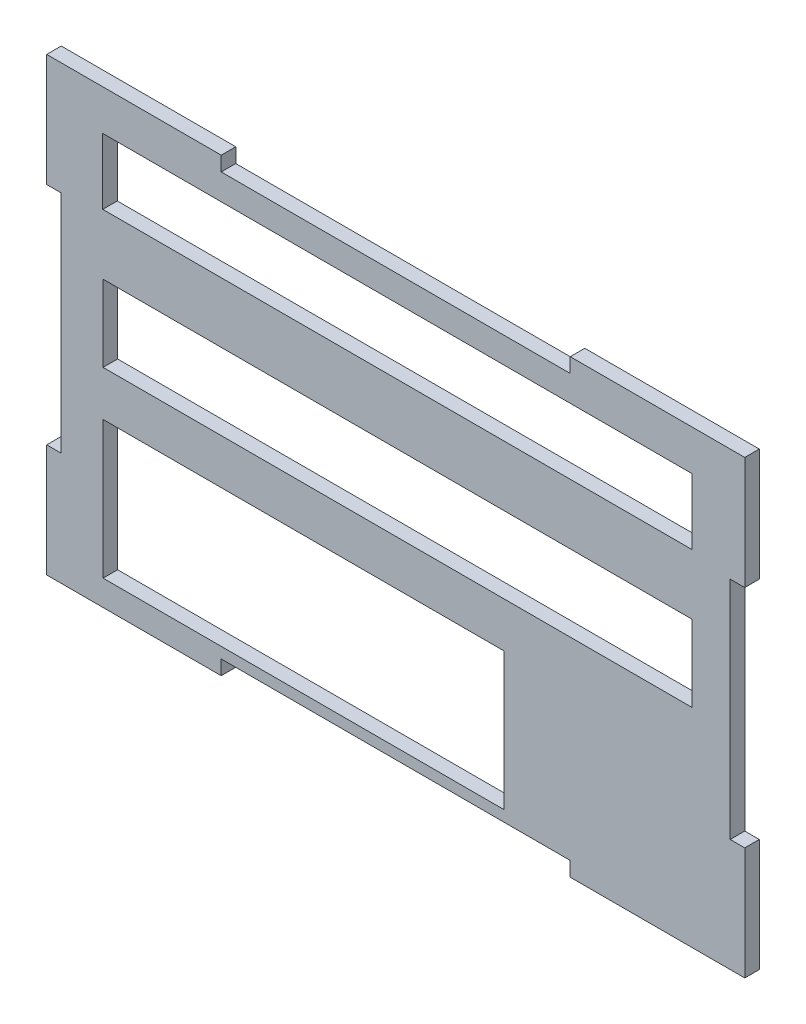
ISO-10303-21;
HEADER;
FILE_DESCRIPTION(('STEP AP214'),'2;1');
FILE_NAME('part.step','',(''),(''),'','','');
FILE_SCHEMA(('AUTOMOTIVE_DESIGN { 1 0 10303 214 1 1 1 1 }'));
ENDSEC;
DATA;
#1=APPLICATION_CONTEXT('core data for automotive mechanical design processes');
#2=APPLICATION_PROTOCOL_DEFINITION('international standard','automotive_design',2000,#1);
#3=PRODUCT_CONTEXT('',#1,'mechanical');
#4=PRODUCT('Part','Part','',(#3));
#5=PRODUCT_RELATED_PRODUCT_CATEGORY('part','',(#4));
#6=PRODUCT_DEFINITION_FORMATION('','',#4);
#7=PRODUCT_DEFINITION_CONTEXT('part definition',#1,'design');
#8=PRODUCT_DEFINITION('design','',#6,#7);
#9=PRODUCT_DEFINITION_SHAPE('','',#8);
#10=(LENGTH_UNIT() NAMED_UNIT(*) SI_UNIT(.MILLI.,.METRE.));
#11=(NAMED_UNIT(*) PLANE_ANGLE_UNIT() SI_UNIT($,.RADIAN.));
#12=(NAMED_UNIT(*) SI_UNIT($,.STERADIAN.) SOLID_ANGLE_UNIT());
#13=UNCERTAINTY_MEASURE_WITH_UNIT(LENGTH_MEASURE(1.E-05),#10,'distance_accuracy_value','');
#14=(GEOMETRIC_REPRESENTATION_CONTEXT(3) GLOBAL_UNCERTAINTY_ASSIGNED_CONTEXT((#13)) GLOBAL_UNIT_ASSIGNED_CONTEXT((#10,
#11,#12)) REPRESENTATION_CONTEXT('',''));
#15=CARTESIAN_POINT('',(0.,0.,0.));
#16=DIRECTION('',(0.,0.,1.));
#17=DIRECTION('',(1.,0.,0.));
#18=AXIS2_PLACEMENT_3D('',#15,#16,#17);
#19=CARTESIAN_POINT('',(53.3111861317648,28.2641509433962,2.));
#20=DIRECTION('',(-1.,0.,0.));
#21=DIRECTION('',(0.,-1.,0.));
#22=AXIS2_PLACEMENT_3D('',#19,#20,#21);
#23=PLANE('',#22);
#24=DIRECTION('',(0.,1.,0.));
#25=VECTOR('',#24,1.);
#26=CARTESIAN_POINT('',(53.3111861317648,28.2641509433962,2.));
#27=LINE('',#26,#25);
#28=CARTESIAN_POINT('',(53.3111861317653,12.7641509433962,2.));
#29=VERTEX_POINT('',#28);
#30=CARTESIAN_POINT('',(53.3111861317648,28.2641509433962,2.));
#31=VERTEX_POINT('',#30);
#32=EDGE_CURVE('E270',#29,#31,#27,.T.);
#33=ORIENTED_EDGE('',*,*,#32,.F.);
#34=DIRECTION('',(0.,0.,-1.));
#35=VECTOR('',#34,1.);
#36=CARTESIAN_POINT('',(53.3111861317653,12.7641509433962,2.));
#37=LINE('',#36,#35);
#38=CARTESIAN_POINT('',(53.3111861317653,12.7641509433962,0.));
#39=VERTEX_POINT('',#38);
#40=EDGE_CURVE('E316',#29,#39,#37,.T.);
#41=ORIENTED_EDGE('',*,*,#40,.T.);
#42=DIRECTION('',(0.,1.,0.));
#43=VECTOR('',#42,1.);
#44=CARTESIAN_POINT('',(53.3111861317648,28.2641509433962,0.));
#45=LINE('',#44,#43);
#46=CARTESIAN_POINT('',(53.3111861317648,28.2641509433962,0.));
#47=VERTEX_POINT('',#46);
#48=EDGE_CURVE('E288',#39,#47,#45,.T.);
#49=ORIENTED_EDGE('',*,*,#48,.T.);
#50=DIRECTION('',(0.,0.,-1.));
#51=VECTOR('',#50,1.);
#52=CARTESIAN_POINT('',(53.3111861317648,28.2641509433962,2.));
#53=LINE('',#52,#51);
#54=EDGE_CURVE('E297',#31,#47,#53,.T.);
#55=ORIENTED_EDGE('',*,*,#54,.F.);
#56=EDGE_LOOP('',(#33,#41,#49,#55));
#57=FACE_BOUND('',#56,.T.);
#58=ADVANCED_FACE('F33',(#57),#23,.F.);
#59=CARTESIAN_POINT('',(-42.6888138682352,28.2641509433962,2.));
#60=DIRECTION('',(1.,0.,0.));
#61=DIRECTION('',(0.,1.,0.));
#62=AXIS2_PLACEMENT_3D('',#59,#60,#61);
#63=PLANE('',#62);
#64=DIRECTION('',(0.,-1.,0.));
#65=VECTOR('',#64,1.);
#66=CARTESIAN_POINT('',(-42.6888138682352,28.2641509433962,2.));
#67=LINE('',#66,#65);
#68=CARTESIAN_POINT('',(-42.6888138682347,-18.2358490566038,2.));
#69=VERTEX_POINT('',#68);
#70=CARTESIAN_POINT('',(-42.6888138682352,-33.7358490566038,2.));
#71=VERTEX_POINT('',#70);
#72=EDGE_CURVE('E294',#69,#71,#67,.T.);
#73=ORIENTED_EDGE('',*,*,#72,.F.);
#74=DIRECTION('',(0.,0.,-1.));
#75=VECTOR('',#74,1.);
#76=CARTESIAN_POINT('',(-42.6888138682347,-18.2358490566038,2.));
#77=LINE('',#76,#75);
#78=CARTESIAN_POINT('',(-42.6888138682347,-18.2358490566038,0.));
#79=VERTEX_POINT('',#78);
#80=EDGE_CURVE('E338',#69,#79,#77,.T.);
#81=ORIENTED_EDGE('',*,*,#80,.T.);
#82=DIRECTION('',(0.,-1.,0.));
#83=VECTOR('',#82,1.);
#84=CARTESIAN_POINT('',(-42.6888138682352,28.2641509433962,0.));
#85=LINE('',#84,#83);
#86=CARTESIAN_POINT('',(-42.6888138682352,-33.7358490566038,0.));
#87=VERTEX_POINT('',#86);
#88=EDGE_CURVE('E284',#79,#87,#85,.T.);
#89=ORIENTED_EDGE('',*,*,#88,.T.);
#90=DIRECTION('',(0.,0.,-1.));
#91=VECTOR('',#90,1.);
#92=CARTESIAN_POINT('',(-42.6888138682352,-33.7358490566038,2.));
#93=LINE('',#92,#91);
#94=EDGE_CURVE('E11',#71,#87,#93,.T.);
#95=ORIENTED_EDGE('',*,*,#94,.F.);
#96=EDGE_LOOP('',(#73,#81,#89,#95));
#97=FACE_BOUND('',#96,.T.);
#98=ADVANCED_FACE('F504',(#97),#63,.F.);
#99=CARTESIAN_POINT('',(-42.6888138682352,28.2641509433962,2.));
#100=DIRECTION('',(0.,-1.,0.));
#101=DIRECTION('',(0.,0.,-1.));
#102=AXIS2_PLACEMENT_3D('',#99,#100,#101);
#103=PLANE('',#102);
#104=DIRECTION('',(-1.,0.,0.));
#105=VECTOR('',#104,1.);
#106=CARTESIAN_POINT('',(-42.6888138682352,28.2641509433962,0.));
#107=LINE('',#106,#105);
#108=CARTESIAN_POINT('',(29.3111861317648,28.2641509433962,0.));
#109=VERTEX_POINT('',#108);
#110=EDGE_CURVE('E291',#47,#109,#107,.T.);
#111=ORIENTED_EDGE('',*,*,#110,.T.);
#112=DIRECTION('',(0.,0.,-1.));
#113=VECTOR('',#112,1.);
#114=CARTESIAN_POINT('',(29.3111861317648,28.2641509433962,2.));
#115=LINE('',#114,#113);
#116=CARTESIAN_POINT('',(29.3111861317648,28.2641509433962,2.));
#117=VERTEX_POINT('',#116);
#118=EDGE_CURVE('E363',#117,#109,#115,.T.);
#119=ORIENTED_EDGE('',*,*,#118,.F.);
#120=DIRECTION('',(-1.,0.,0.));
#121=VECTOR('',#120,1.);
#122=CARTESIAN_POINT('',(-42.6888138682352,28.2641509433962,2.));
#123=LINE('',#122,#121);
#124=EDGE_CURVE('E272',#31,#117,#123,.T.);
#125=ORIENTED_EDGE('',*,*,#124,.F.);
#126=ORIENTED_EDGE('',*,*,#54,.T.);
#127=EDGE_LOOP('',(#111,#119,#125,#126));
#128=FACE_BOUND('',#127,.T.);
#129=ADVANCED_FACE('F520',(#128),#103,.F.);
#130=CARTESIAN_POINT('',(-42.6888138682352,-33.7358490566038,2.));
#131=DIRECTION('',(0.,1.,0.));
#132=DIRECTION('',(0.,0.,1.));
#133=AXIS2_PLACEMENT_3D('',#130,#131,#132);
#134=PLANE('',#133);
#135=DIRECTION('',(1.,0.,0.));
#136=VECTOR('',#135,1.);
#137=CARTESIAN_POINT('',(-42.6888138682352,-33.7358490566038,2.));
#138=LINE('',#137,#136);
#139=CARTESIAN_POINT('',(29.3111861317648,-33.7358490566038,2.));
#140=VERTEX_POINT('',#139);
#141=CARTESIAN_POINT('',(53.3111861317648,-33.7358490566038,2.));
#142=VERTEX_POINT('',#141);
#143=EDGE_CURVE('E267',#140,#142,#138,.T.);
#144=ORIENTED_EDGE('',*,*,#143,.F.);
#145=DIRECTION('',(0.,0.,-1.));
#146=VECTOR('',#145,1.);
#147=CARTESIAN_POINT('',(29.3111861317648,-33.7358490566038,2.));
#148=LINE('',#147,#146);
#149=CARTESIAN_POINT('',(29.3111861317648,-33.7358490566038,0.));
#150=VERTEX_POINT('',#149);
#151=EDGE_CURVE('E382',#140,#150,#148,.T.);
#152=ORIENTED_EDGE('',*,*,#151,.T.);
#153=DIRECTION('',(1.,0.,0.));
#154=VECTOR('',#153,1.);
#155=CARTESIAN_POINT('',(-42.6888138682352,-33.7358490566038,0.));
#156=LINE('',#155,#154);
#157=CARTESIAN_POINT('',(53.3111861317648,-33.7358490566038,0.));
#158=VERTEX_POINT('',#157);
#159=EDGE_CURVE('E283',#150,#158,#156,.T.);
#160=ORIENTED_EDGE('',*,*,#159,.T.);
#161=DIRECTION('',(0.,0.,-1.));
#162=VECTOR('',#161,1.);
#163=CARTESIAN_POINT('',(53.3111861317648,-33.7358490566038,2.));
#164=LINE('',#163,#162);
#165=EDGE_CURVE('E41',#142,#158,#164,.T.);
#166=ORIENTED_EDGE('',*,*,#165,.F.);
#167=EDGE_LOOP('',(#144,#152,#160,#166));
#168=FACE_BOUND('',#167,.T.);
#169=ADVANCED_FACE('F518',(#168),#134,.F.);
#170=CARTESIAN_POINT('',(-42.6888138682352,28.2641509433962,0.));
#171=VERTEX_POINT('',#170);
#172=CARTESIAN_POINT('',(-42.6888138682352,12.7641509433962,0.));
#173=VERTEX_POINT('',#172);
#174=EDGE_CURVE('E280',#171,#173,#85,.T.);
#175=ORIENTED_EDGE('',*,*,#174,.T.);
#176=DIRECTION('',(0.,0.,-1.));
#177=VECTOR('',#176,1.);
#178=CARTESIAN_POINT('',(-42.6888138682347,12.7641509433962,2.));
#179=LINE('',#178,#177);
#180=CARTESIAN_POINT('',(-42.6888138682347,12.7641509433962,2.));
#181=VERTEX_POINT('',#180);
#182=EDGE_CURVE('E56',#181,#173,#179,.T.);
#183=ORIENTED_EDGE('',*,*,#182,.F.);
#184=CARTESIAN_POINT('',(-42.6888138682352,28.2641509433962,2.));
#185=VERTEX_POINT('',#184);
#186=EDGE_CURVE('E492',#185,#181,#67,.T.);
#187=ORIENTED_EDGE('',*,*,#186,.F.);
#188=DIRECTION('',(0.,0.,-1.));
#189=VECTOR('',#188,1.);
#190=CARTESIAN_POINT('',(-42.6888138682352,28.2641509433962,2.));
#191=LINE('',#190,#189);
#192=EDGE_CURVE('E279',#185,#171,#191,.T.);
#193=ORIENTED_EDGE('',*,*,#192,.T.);
#194=EDGE_LOOP('',(#175,#183,#187,#193));
#195=FACE_BOUND('',#194,.T.);
#196=ADVANCED_FACE('F35',(#195),#63,.F.);
#197=CARTESIAN_POINT('',(-18.6888138682352,-33.7358490566038,0.));
#198=VERTEX_POINT('',#197);
#199=EDGE_CURVE('E285',#87,#198,#156,.T.);
#200=ORIENTED_EDGE('',*,*,#199,.T.);
#201=DIRECTION('',(0.,0.,-1.));
#202=VECTOR('',#201,1.);
#203=CARTESIAN_POINT('',(-18.6888138682352,-33.7358490566038,2.));
#204=LINE('',#203,#202);
#205=CARTESIAN_POINT('',(-18.6888138682352,-33.7358490566038,2.));
#206=VERTEX_POINT('',#205);
#207=EDGE_CURVE('E394',#206,#198,#204,.T.);
#208=ORIENTED_EDGE('',*,*,#207,.F.);
#209=EDGE_CURVE('E274',#71,#206,#138,.T.);
#210=ORIENTED_EDGE('',*,*,#209,.F.);
#211=ORIENTED_EDGE('',*,*,#94,.T.);
#212=EDGE_LOOP('',(#200,#208,#210,#211));
#213=FACE_BOUND('',#212,.T.);
#214=ADVANCED_FACE('F503',(#213),#134,.F.);
#215=CARTESIAN_POINT('',(53.3111861317648,-18.2358490566038,0.));
#216=VERTEX_POINT('',#215);
#217=EDGE_CURVE('E259',#158,#216,#45,.T.);
#218=ORIENTED_EDGE('',*,*,#217,.T.);
#219=DIRECTION('',(0.,0.,-1.));
#220=VECTOR('',#219,1.);
#221=CARTESIAN_POINT('',(53.3111861317653,-18.2358490566038,2.));
#222=LINE('',#221,#220);
#223=CARTESIAN_POINT('',(53.3111861317653,-18.2358490566038,2.));
#224=VERTEX_POINT('',#223);
#225=EDGE_CURVE('E48',#224,#216,#222,.T.);
#226=ORIENTED_EDGE('',*,*,#225,.F.);
#227=EDGE_CURVE('E257',#142,#224,#27,.T.);
#228=ORIENTED_EDGE('',*,*,#227,.F.);
#229=ORIENTED_EDGE('',*,*,#165,.T.);
#230=EDGE_LOOP('',(#218,#226,#228,#229));
#231=FACE_BOUND('',#230,.T.);
#232=ADVANCED_FACE('F255',(#231),#23,.F.);
#233=CARTESIAN_POINT('',(-18.6888138682352,28.2641509433962,2.));
#234=VERTEX_POINT('',#233);
#235=EDGE_CURVE('E269',#234,#185,#123,.T.);
#236=ORIENTED_EDGE('',*,*,#235,.F.);
#237=DIRECTION('',(0.,0.,-1.));
#238=VECTOR('',#237,1.);
#239=CARTESIAN_POINT('',(-18.6888138682352,28.2641509433962,2.));
#240=LINE('',#239,#238);
#241=CARTESIAN_POINT('',(-18.6888138682352,28.2641509433962,0.));
#242=VERTEX_POINT('',#241);
#243=EDGE_CURVE('E366',#234,#242,#240,.T.);
#244=ORIENTED_EDGE('',*,*,#243,.T.);
#245=EDGE_CURVE('E290',#242,#171,#107,.T.);
#246=ORIENTED_EDGE('',*,*,#245,.T.);
#247=ORIENTED_EDGE('',*,*,#192,.F.);
#248=EDGE_LOOP('',(#236,#244,#246,#247));
#249=FACE_BOUND('',#248,.T.);
#250=ADVANCED_FACE('F530',(#249),#103,.F.);
#251=CARTESIAN_POINT('',(0.,0.,2.));
#252=DIRECTION('',(0.,0.,1.));
#253=DIRECTION('',(1.,0.,0.));
#254=AXIS2_PLACEMENT_3D('',#251,#252,#253);
#255=PLANE('',#254);
#256=DIRECTION('',(1.,0.,0.));
#257=VECTOR('',#256,1.);
#258=CARTESIAN_POINT('',(53.3111861317653,12.7641509433962,2.));
#259=LINE('',#258,#257);
#260=CARTESIAN_POINT('',(51.3111861317653,12.7641509433962,2.));
#261=VERTEX_POINT('',#260);
#262=EDGE_CURVE('E260',#261,#29,#259,.T.);
#263=ORIENTED_EDGE('',*,*,#262,.T.);
#264=ORIENTED_EDGE('',*,*,#32,.T.);
#265=ORIENTED_EDGE('',*,*,#124,.T.);
#266=DIRECTION('',(0.,-1.,0.));
#267=VECTOR('',#266,1.);
#268=CARTESIAN_POINT('',(29.3111861317648,28.2641509433962,2.));
#269=LINE('',#268,#267);
#270=CARTESIAN_POINT('',(29.3111861317648,26.2641509433962,2.));
#271=VERTEX_POINT('',#270);
#272=EDGE_CURVE('E347',#117,#271,#269,.T.);
#273=ORIENTED_EDGE('',*,*,#272,.T.);
#274=DIRECTION('',(-1.,0.,0.));
#275=VECTOR('',#274,1.);
#276=CARTESIAN_POINT('',(29.3111861317648,26.2641509433962,2.));
#277=LINE('',#276,#275);
#278=CARTESIAN_POINT('',(-18.6888138682352,26.2641509433962,2.));
#279=VERTEX_POINT('',#278);
#280=EDGE_CURVE('E350',#271,#279,#277,.T.);
#281=ORIENTED_EDGE('',*,*,#280,.T.);
#282=DIRECTION('',(0.,1.,0.));
#283=VECTOR('',#282,1.);
#284=CARTESIAN_POINT('',(-18.6888138682352,28.2641509433962,2.));
#285=LINE('',#284,#283);
#286=EDGE_CURVE('E354',#279,#234,#285,.T.);
#287=ORIENTED_EDGE('',*,*,#286,.T.);
#288=ORIENTED_EDGE('',*,*,#235,.T.);
#289=ORIENTED_EDGE('',*,*,#186,.T.);
#290=DIRECTION('',(1.,0.,0.));
#291=VECTOR('',#290,1.);
#292=CARTESIAN_POINT('',(-42.6888138682347,12.7641509433962,2.));
#293=LINE('',#292,#291);
#294=CARTESIAN_POINT('',(-40.6888138682347,12.7641509433962,2.));
#295=VERTEX_POINT('',#294);
#296=EDGE_CURVE('E323',#181,#295,#293,.T.);
#297=ORIENTED_EDGE('',*,*,#296,.T.);
#298=DIRECTION('',(0.,-1.,0.));
#299=VECTOR('',#298,1.);
#300=CARTESIAN_POINT('',(-40.6888138682347,12.7641509433962,2.));
#301=LINE('',#300,#299);
#302=CARTESIAN_POINT('',(-40.6888138682347,-18.2358490566038,2.));
#303=VERTEX_POINT('',#302);
#304=EDGE_CURVE('E326',#295,#303,#301,.T.);
#305=ORIENTED_EDGE('',*,*,#304,.T.);
#306=DIRECTION('',(-1.,0.,0.));
#307=VECTOR('',#306,1.);
#308=CARTESIAN_POINT('',(-42.6888138682347,-18.2358490566038,2.));
#309=LINE('',#308,#307);
#310=EDGE_CURVE('E330',#303,#69,#309,.T.);
#311=ORIENTED_EDGE('',*,*,#310,.T.);
#312=ORIENTED_EDGE('',*,*,#72,.T.);
#313=ORIENTED_EDGE('',*,*,#209,.T.);
#314=DIRECTION('',(0.,1.,0.));
#315=VECTOR('',#314,1.);
#316=CARTESIAN_POINT('',(-18.6888138682352,-33.7358490566038,2.));
#317=LINE('',#316,#315);
#318=CARTESIAN_POINT('',(-18.6888138682352,-31.7358490566038,2.));
#319=VERTEX_POINT('',#318);
#320=EDGE_CURVE('E375',#206,#319,#317,.T.);
#321=ORIENTED_EDGE('',*,*,#320,.T.);
#322=DIRECTION('',(1.,0.,0.));
#323=VECTOR('',#322,1.);
#324=CARTESIAN_POINT('',(29.3111861317648,-31.7358490566038,2.));
#325=LINE('',#324,#323);
#326=CARTESIAN_POINT('',(29.3111861317648,-31.7358490566038,2.));
#327=VERTEX_POINT('',#326);
#328=EDGE_CURVE('E379',#319,#327,#325,.T.);
#329=ORIENTED_EDGE('',*,*,#328,.T.);
#330=DIRECTION('',(0.,-1.,0.));
#331=VECTOR('',#330,1.);
#332=CARTESIAN_POINT('',(29.3111861317648,-33.7358490566038,2.));
#333=LINE('',#332,#331);
#334=EDGE_CURVE('E373',#327,#140,#333,.T.);
#335=ORIENTED_EDGE('',*,*,#334,.T.);
#336=ORIENTED_EDGE('',*,*,#143,.T.);
#337=ORIENTED_EDGE('',*,*,#227,.T.);
#338=DIRECTION('',(-1.,0.,0.));
#339=VECTOR('',#338,1.);
#340=CARTESIAN_POINT('',(53.3111861317653,-18.2358490566038,2.));
#341=LINE('',#340,#339);
#342=CARTESIAN_POINT('',(51.3111861317653,-18.2358490566038,2.));
#343=VERTEX_POINT('',#342);
#344=EDGE_CURVE('E242',#224,#343,#341,.T.);
#345=ORIENTED_EDGE('',*,*,#344,.T.);
#346=DIRECTION('',(0.,1.,0.));
#347=VECTOR('',#346,1.);
#348=CARTESIAN_POINT('',(51.3111861317653,12.7641509433962,2.));
#349=LINE('',#348,#347);
#350=EDGE_CURVE('E249',#343,#261,#349,.T.);
#351=ORIENTED_EDGE('',*,*,#350,.T.);
#352=EDGE_LOOP('',(#263,#264,#265,#273,#281,#287,#288,#289,#297,#305,#311,#312,#313,#321,#329,
#335,#336,#337,#345,#351));
#353=FACE_BOUND('',#352,.T.);
#354=DIRECTION('',(0.,-1.,0.));
#355=VECTOR('',#354,1.);
#356=CARTESIAN_POINT('',(20.1861861317646,-11.3358490566038,2.));
#357=LINE('',#356,#355);
#358=CARTESIAN_POINT('',(20.1861861317646,-11.3358490566038,2.));
#359=VERTEX_POINT('',#358);
#360=CARTESIAN_POINT('',(20.1861861317646,-30.2372490566038,2.));
#361=VERTEX_POINT('',#360);
#362=EDGE_CURVE('E398',#359,#361,#357,.T.);
#363=ORIENTED_EDGE('',*,*,#362,.T.);
#364=DIRECTION('',(-1.,0.,0.));
#365=VECTOR('',#364,1.);
#366=CARTESIAN_POINT('',(20.1861861317646,-30.2372490566038,2.));
#367=LINE('',#366,#365);
#368=CARTESIAN_POINT('',(-34.9388138682354,-30.2372490566038,2.));
#369=VERTEX_POINT('',#368);
#370=EDGE_CURVE('E401',#361,#369,#367,.T.);
#371=ORIENTED_EDGE('',*,*,#370,.T.);
#372=DIRECTION('',(0.,1.,0.));
#373=VECTOR('',#372,1.);
#374=CARTESIAN_POINT('',(-34.9388138682354,-11.3358490566038,2.));
#375=LINE('',#374,#373);
#376=CARTESIAN_POINT('',(-34.9388138682354,-11.3358490566038,2.));
#377=VERTEX_POINT('',#376);
#378=EDGE_CURVE('E405',#369,#377,#375,.T.);
#379=ORIENTED_EDGE('',*,*,#378,.T.);
#380=DIRECTION('',(1.,0.,0.));
#381=VECTOR('',#380,1.);
#382=CARTESIAN_POINT('',(20.1861861317646,-11.3358490566038,2.));
#383=LINE('',#382,#381);
#384=EDGE_CURVE('E408',#377,#359,#383,.T.);
#385=ORIENTED_EDGE('',*,*,#384,.T.);
#386=EDGE_LOOP('',(#363,#371,#379,#385));
#387=FACE_BOUND('',#386,.T.);
#388=DIRECTION('',(0.,-1.,0.));
#389=VECTOR('',#388,1.);
#390=CARTESIAN_POINT('',(46.0611861317653,5.36922892212201,2.));
#391=LINE('',#390,#389);
#392=CARTESIAN_POINT('',(46.0611861317653,5.36922892212201,2.));
#393=VERTEX_POINT('',#392);
#394=CARTESIAN_POINT('',(46.0611861317653,-5.13584905660378,2.));
#395=VERTEX_POINT('',#394);
#396=EDGE_CURVE('E431',#393,#395,#391,.T.);
#397=ORIENTED_EDGE('',*,*,#396,.T.);
#398=DIRECTION('',(-1.,0.,0.));
#399=VECTOR('',#398,1.);
#400=CARTESIAN_POINT('',(46.0611861317653,-5.13584905660378,2.));
#401=LINE('',#400,#399);
#402=CARTESIAN_POINT('',(-34.9388138682346,-5.13584905660378,2.));
#403=VERTEX_POINT('',#402);
#404=EDGE_CURVE('E434',#395,#403,#401,.T.);
#405=ORIENTED_EDGE('',*,*,#404,.T.);
#406=DIRECTION('',(0.,1.,0.));
#407=VECTOR('',#406,1.);
#408=CARTESIAN_POINT('',(-34.9388138682346,5.36922892212201,2.));
#409=LINE('',#408,#407);
#410=CARTESIAN_POINT('',(-34.9388138682346,5.36922892212201,2.));
#411=VERTEX_POINT('',#410);
#412=EDGE_CURVE('E438',#403,#411,#409,.T.);
#413=ORIENTED_EDGE('',*,*,#412,.T.);
#414=DIRECTION('',(1.,0.,0.));
#415=VECTOR('',#414,1.);
#416=CARTESIAN_POINT('',(46.0611861317653,5.36922892212201,2.));
#417=LINE('',#416,#415);
#418=EDGE_CURVE('E441',#411,#393,#417,.T.);
#419=ORIENTED_EDGE('',*,*,#418,.T.);
#420=EDGE_LOOP('',(#397,#405,#413,#419));
#421=FACE_BOUND('',#420,.T.);
#422=DIRECTION('',(0.,-1.,0.));
#423=VECTOR('',#422,1.);
#424=CARTESIAN_POINT('',(46.0611861317651,22.7076260939753,2.));
#425=LINE('',#424,#423);
#426=CARTESIAN_POINT('',(46.0611861317651,22.7076260939753,2.));
#427=VERTEX_POINT('',#426);
#428=CARTESIAN_POINT('',(46.0611861317651,13.6641509433962,2.));
#429=VERTEX_POINT('',#428);
#430=EDGE_CURVE('E463',#427,#429,#425,.T.);
#431=ORIENTED_EDGE('',*,*,#430,.T.);
#432=DIRECTION('',(-1.,0.,0.));
#433=VECTOR('',#432,1.);
#434=CARTESIAN_POINT('',(46.0611861317651,13.6641509433962,2.));
#435=LINE('',#434,#433);
#436=CARTESIAN_POINT('',(-34.9808845687351,13.6641509433962,2.));
#437=VERTEX_POINT('',#436);
#438=EDGE_CURVE('E466',#429,#437,#435,.T.);
#439=ORIENTED_EDGE('',*,*,#438,.T.);
#440=DIRECTION('',(0.,1.,0.));
#441=VECTOR('',#440,1.);
#442=CARTESIAN_POINT('',(-34.9808845687351,22.7076260939753,2.));
#443=LINE('',#442,#441);
#444=CARTESIAN_POINT('',(-34.9808845687351,22.7076260939753,2.));
#445=VERTEX_POINT('',#444);
#446=EDGE_CURVE('E470',#437,#445,#443,.T.);
#447=ORIENTED_EDGE('',*,*,#446,.T.);
#448=DIRECTION('',(1.,0.,0.));
#449=VECTOR('',#448,1.);
#450=CARTESIAN_POINT('',(46.0611861317651,22.7076260939753,2.));
#451=LINE('',#450,#449);
#452=EDGE_CURVE('E473',#445,#427,#451,.T.);
#453=ORIENTED_EDGE('',*,*,#452,.T.);
#454=EDGE_LOOP('',(#431,#439,#447,#453));
#455=FACE_BOUND('',#454,.T.);
#456=ADVANCED_FACE('F263',(#353,#387,#421,#455),#255,.T.);
#457=CARTESIAN_POINT('',(0.,0.,0.));
#458=DIRECTION('',(0.,0.,1.));
#459=DIRECTION('',(1.,0.,0.));
#460=AXIS2_PLACEMENT_3D('',#457,#458,#459);
#461=PLANE('',#460);
#462=DIRECTION('',(-1.,0.,0.));
#463=VECTOR('',#462,1.);
#464=CARTESIAN_POINT('',(20.1861861317646,-30.2372490566038,0.));
#465=LINE('',#464,#463);
#466=CARTESIAN_POINT('',(20.1861861317646,-30.2372490566038,0.));
#467=VERTEX_POINT('',#466);
#468=CARTESIAN_POINT('',(-34.9388138682354,-30.2372490566038,0.));
#469=VERTEX_POINT('',#468);
#470=EDGE_CURVE('E414',#467,#469,#465,.T.);
#471=ORIENTED_EDGE('',*,*,#470,.F.);
#472=DIRECTION('',(0.,-1.,0.));
#473=VECTOR('',#472,1.);
#474=CARTESIAN_POINT('',(20.1861861317646,-11.3358490566038,0.));
#475=LINE('',#474,#473);
#476=CARTESIAN_POINT('',(20.1861861317646,-11.3358490566038,0.));
#477=VERTEX_POINT('',#476);
#478=EDGE_CURVE('E412',#477,#467,#475,.T.);
#479=ORIENTED_EDGE('',*,*,#478,.F.);
#480=DIRECTION('',(1.,0.,0.));
#481=VECTOR('',#480,1.);
#482=CARTESIAN_POINT('',(20.1861861317646,-11.3358490566038,0.));
#483=LINE('',#482,#481);
#484=CARTESIAN_POINT('',(-34.9388138682354,-11.3358490566038,0.));
#485=VERTEX_POINT('',#484);
#486=EDGE_CURVE('E402',#485,#477,#483,.T.);
#487=ORIENTED_EDGE('',*,*,#486,.F.);
#488=DIRECTION('',(0.,1.,0.));
#489=VECTOR('',#488,1.);
#490=CARTESIAN_POINT('',(-34.9388138682354,-11.3358490566038,0.));
#491=LINE('',#490,#489);
#492=EDGE_CURVE('E418',#469,#485,#491,.T.);
#493=ORIENTED_EDGE('',*,*,#492,.F.);
#494=EDGE_LOOP('',(#471,#479,#487,#493));
#495=FACE_BOUND('',#494,.T.);
#496=DIRECTION('',(-1.,0.,0.));
#497=VECTOR('',#496,1.);
#498=CARTESIAN_POINT('',(46.0611861317653,-5.13584905660378,0.));
#499=LINE('',#498,#497);
#500=CARTESIAN_POINT('',(46.0611861317653,-5.13584905660378,0.));
#501=VERTEX_POINT('',#500);
#502=CARTESIAN_POINT('',(-34.9388138682346,-5.13584905660378,0.));
#503=VERTEX_POINT('',#502);
#504=EDGE_CURVE('E447',#501,#503,#499,.T.);
#505=ORIENTED_EDGE('',*,*,#504,.F.);
#506=DIRECTION('',(0.,-1.,0.));
#507=VECTOR('',#506,1.);
#508=CARTESIAN_POINT('',(46.0611861317653,5.36922892212201,0.));
#509=LINE('',#508,#507);
#510=CARTESIAN_POINT('',(46.0611861317653,5.36922892212201,0.));
#511=VERTEX_POINT('',#510);
#512=EDGE_CURVE('E445',#511,#501,#509,.T.);
#513=ORIENTED_EDGE('',*,*,#512,.F.);
#514=DIRECTION('',(1.,0.,0.));
#515=VECTOR('',#514,1.);
#516=CARTESIAN_POINT('',(46.0611861317653,5.36922892212201,0.));
#517=LINE('',#516,#515);
#518=CARTESIAN_POINT('',(-34.9388138682346,5.36922892212201,0.));
#519=VERTEX_POINT('',#518);
#520=EDGE_CURVE('E435',#519,#511,#517,.T.);
#521=ORIENTED_EDGE('',*,*,#520,.F.);
#522=DIRECTION('',(0.,1.,0.));
#523=VECTOR('',#522,1.);
#524=CARTESIAN_POINT('',(-34.9388138682346,5.36922892212201,0.));
#525=LINE('',#524,#523);
#526=EDGE_CURVE('E451',#503,#519,#525,.T.);
#527=ORIENTED_EDGE('',*,*,#526,.F.);
#528=EDGE_LOOP('',(#505,#513,#521,#527));
#529=FACE_BOUND('',#528,.T.);
#530=DIRECTION('',(-1.,0.,0.));
#531=VECTOR('',#530,1.);
#532=CARTESIAN_POINT('',(46.0611861317651,13.6641509433962,0.));
#533=LINE('',#532,#531);
#534=CARTESIAN_POINT('',(46.0611861317651,13.6641509433962,0.));
#535=VERTEX_POINT('',#534);
#536=CARTESIAN_POINT('',(-34.9808845687351,13.6641509433962,0.));
#537=VERTEX_POINT('',#536);
#538=EDGE_CURVE('E478',#535,#537,#533,.T.);
#539=ORIENTED_EDGE('',*,*,#538,.F.);
#540=DIRECTION('',(0.,-1.,0.));
#541=VECTOR('',#540,1.);
#542=CARTESIAN_POINT('',(46.0611861317651,22.7076260939753,0.));
#543=LINE('',#542,#541);
#544=CARTESIAN_POINT('',(46.0611861317651,22.7076260939753,0.));
#545=VERTEX_POINT('',#544);
#546=EDGE_CURVE('E391',#545,#535,#543,.T.);
#547=ORIENTED_EDGE('',*,*,#546,.F.);
#548=DIRECTION('',(1.,0.,0.));
#549=VECTOR('',#548,1.);
#550=CARTESIAN_POINT('',(46.0611861317651,22.7076260939753,0.));
#551=LINE('',#550,#549);
#552=CARTESIAN_POINT('',(-34.9808845687351,22.7076260939753,0.));
#553=VERTEX_POINT('',#552);
#554=EDGE_CURVE('E467',#553,#545,#551,.T.);
#555=ORIENTED_EDGE('',*,*,#554,.F.);
#556=DIRECTION('',(0.,1.,0.));
#557=VECTOR('',#556,1.);
#558=CARTESIAN_POINT('',(-34.9808845687351,22.7076260939753,0.));
#559=LINE('',#558,#557);
#560=EDGE_CURVE('E481',#537,#553,#559,.T.);
#561=ORIENTED_EDGE('',*,*,#560,.F.);
#562=EDGE_LOOP('',(#539,#547,#555,#561));
#563=FACE_BOUND('',#562,.T.);
#564=ORIENTED_EDGE('',*,*,#48,.F.);
#565=DIRECTION('',(1.,0.,0.));
#566=VECTOR('',#565,1.);
#567=CARTESIAN_POINT('',(53.3111861317653,12.7641509433962,0.));
#568=LINE('',#567,#566);
#569=CARTESIAN_POINT('',(51.3111861317653,12.7641509433962,0.));
#570=VERTEX_POINT('',#569);
#571=EDGE_CURVE('E250',#570,#39,#568,.T.);
#572=ORIENTED_EDGE('',*,*,#571,.F.);
#573=DIRECTION('',(0.,1.,0.));
#574=VECTOR('',#573,1.);
#575=CARTESIAN_POINT('',(51.3111861317653,12.7641509433962,0.));
#576=LINE('',#575,#574);
#577=CARTESIAN_POINT('',(51.3111861317653,-18.2358490566038,0.));
#578=VERTEX_POINT('',#577);
#579=EDGE_CURVE('E309',#578,#570,#576,.T.);
#580=ORIENTED_EDGE('',*,*,#579,.F.);
#581=DIRECTION('',(-1.,0.,0.));
#582=VECTOR('',#581,1.);
#583=CARTESIAN_POINT('',(53.3111861317653,-18.2358490566038,0.));
#584=LINE('',#583,#582);
#585=EDGE_CURVE('E306',#216,#578,#584,.T.);
#586=ORIENTED_EDGE('',*,*,#585,.F.);
#587=ORIENTED_EDGE('',*,*,#217,.F.);
#588=ORIENTED_EDGE('',*,*,#159,.F.);
#589=DIRECTION('',(0.,-1.,0.));
#590=VECTOR('',#589,1.);
#591=CARTESIAN_POINT('',(29.3111861317648,-33.7358490566038,0.));
#592=LINE('',#591,#590);
#593=CARTESIAN_POINT('',(29.3111861317648,-31.7358490566038,0.));
#594=VERTEX_POINT('',#593);
#595=EDGE_CURVE('E365',#594,#150,#592,.T.);
#596=ORIENTED_EDGE('',*,*,#595,.F.);
#597=DIRECTION('',(1.,0.,0.));
#598=VECTOR('',#597,1.);
#599=CARTESIAN_POINT('',(29.3111861317648,-31.7358490566038,0.));
#600=LINE('',#599,#598);
#601=CARTESIAN_POINT('',(-18.6888138682352,-31.7358490566038,0.));
#602=VERTEX_POINT('',#601);
#603=EDGE_CURVE('E376',#602,#594,#600,.T.);
#604=ORIENTED_EDGE('',*,*,#603,.F.);
#605=DIRECTION('',(0.,1.,0.));
#606=VECTOR('',#605,1.);
#607=CARTESIAN_POINT('',(-18.6888138682352,-33.7358490566038,0.));
#608=LINE('',#607,#606);
#609=EDGE_CURVE('E384',#198,#602,#608,.T.);
#610=ORIENTED_EDGE('',*,*,#609,.F.);
#611=ORIENTED_EDGE('',*,*,#199,.F.);
#612=ORIENTED_EDGE('',*,*,#88,.F.);
#613=DIRECTION('',(-1.,0.,0.));
#614=VECTOR('',#613,1.);
#615=CARTESIAN_POINT('',(-42.6888138682347,-18.2358490566038,0.));
#616=LINE('',#615,#614);
#617=CARTESIAN_POINT('',(-40.6888138682347,-18.2358490566038,0.));
#618=VERTEX_POINT('',#617);
#619=EDGE_CURVE('E327',#618,#79,#616,.T.);
#620=ORIENTED_EDGE('',*,*,#619,.F.);
#621=DIRECTION('',(0.,-1.,0.));
#622=VECTOR('',#621,1.);
#623=CARTESIAN_POINT('',(-40.6888138682347,12.7641509433962,0.));
#624=LINE('',#623,#622);
#625=CARTESIAN_POINT('',(-40.6888138682347,12.7641509433962,0.));
#626=VERTEX_POINT('',#625);
#627=EDGE_CURVE('E334',#626,#618,#624,.T.);
#628=ORIENTED_EDGE('',*,*,#627,.F.);
#629=DIRECTION('',(1.,0.,0.));
#630=VECTOR('',#629,1.);
#631=CARTESIAN_POINT('',(-42.6888138682347,12.7641509433962,0.));
#632=LINE('',#631,#630);
#633=EDGE_CURVE('E319',#173,#626,#632,.T.);
#634=ORIENTED_EDGE('',*,*,#633,.F.);
#635=ORIENTED_EDGE('',*,*,#174,.F.);
#636=ORIENTED_EDGE('',*,*,#245,.F.);
#637=DIRECTION('',(0.,1.,0.));
#638=VECTOR('',#637,1.);
#639=CARTESIAN_POINT('',(-18.6888138682352,28.2641509433962,0.));
#640=LINE('',#639,#638);
#641=CARTESIAN_POINT('',(-18.6888138682352,26.2641509433962,0.));
#642=VERTEX_POINT('',#641);
#643=EDGE_CURVE('E351',#642,#242,#640,.T.);
#644=ORIENTED_EDGE('',*,*,#643,.F.);
#645=DIRECTION('',(-1.,0.,0.));
#646=VECTOR('',#645,1.);
#647=CARTESIAN_POINT('',(29.3111861317648,26.2641509433962,0.));
#648=LINE('',#647,#646);
#649=CARTESIAN_POINT('',(29.3111861317648,26.2641509433962,0.));
#650=VERTEX_POINT('',#649);
#651=EDGE_CURVE('E359',#650,#642,#648,.T.);
#652=ORIENTED_EDGE('',*,*,#651,.F.);
#653=DIRECTION('',(0.,-1.,0.));
#654=VECTOR('',#653,1.);
#655=CARTESIAN_POINT('',(29.3111861317648,28.2641509433962,0.));
#656=LINE('',#655,#654);
#657=EDGE_CURVE('E341',#109,#650,#656,.T.);
#658=ORIENTED_EDGE('',*,*,#657,.F.);
#659=ORIENTED_EDGE('',*,*,#110,.F.);
#660=EDGE_LOOP('',(#564,#572,#580,#586,#587,#588,#596,#604,#610,#611,#612,#620,#628,#634,#635,
#636,#644,#652,#658,#659));
#661=FACE_BOUND('',#660,.T.);
#662=ADVANCED_FACE('F303',(#495,#529,#563,#661),#461,.F.);
#663=CARTESIAN_POINT('',(46.0611861317651,22.7076260939753,2.));
#664=DIRECTION('',(1.,0.,0.));
#665=DIRECTION('',(0.,0.,-1.));
#666=AXIS2_PLACEMENT_3D('',#663,#664,#665);
#667=PLANE('',#666);
#668=ORIENTED_EDGE('',*,*,#546,.T.);
#669=DIRECTION('',(0.,0.,-1.));
#670=VECTOR('',#669,1.);
#671=CARTESIAN_POINT('',(46.0611861317651,13.6641509433962,2.));
#672=LINE('',#671,#670);
#673=EDGE_CURVE('E476',#429,#535,#672,.T.);
#674=ORIENTED_EDGE('',*,*,#673,.F.);
#675=ORIENTED_EDGE('',*,*,#430,.F.);
#676=DIRECTION('',(0.,0.,-1.));
#677=VECTOR('',#676,1.);
#678=CARTESIAN_POINT('',(46.0611861317651,22.7076260939753,2.));
#679=LINE('',#678,#677);
#680=EDGE_CURVE('E448',#427,#545,#679,.T.);
#681=ORIENTED_EDGE('',*,*,#680,.T.);
#682=EDGE_LOOP('',(#668,#674,#675,#681));
#683=FACE_BOUND('',#682,.T.);
#684=ADVANCED_FACE('F552',(#683),#667,.F.);
#685=CARTESIAN_POINT('',(46.0611861317651,22.7076260939753,2.));
#686=DIRECTION('',(0.,1.,0.));
#687=DIRECTION('',(0.,0.,1.));
#688=AXIS2_PLACEMENT_3D('',#685,#686,#687);
#689=PLANE('',#688);
#690=ORIENTED_EDGE('',*,*,#554,.T.);
#691=ORIENTED_EDGE('',*,*,#680,.F.);
#692=ORIENTED_EDGE('',*,*,#452,.F.);
#693=DIRECTION('',(0.,0.,-1.));
#694=VECTOR('',#693,1.);
#695=CARTESIAN_POINT('',(-34.9808845687351,22.7076260939753,2.));
#696=LINE('',#695,#694);
#697=EDGE_CURVE('E487',#445,#553,#696,.T.);
#698=ORIENTED_EDGE('',*,*,#697,.T.);
#699=EDGE_LOOP('',(#690,#691,#692,#698));
#700=FACE_BOUND('',#699,.T.);
#701=ADVANCED_FACE('F557',(#700),#689,.F.);
#702=CARTESIAN_POINT('',(-34.9808845687351,22.7076260939753,2.));
#703=DIRECTION('',(-1.,0.,0.));
#704=DIRECTION('',(0.,0.,1.));
#705=AXIS2_PLACEMENT_3D('',#702,#703,#704);
#706=PLANE('',#705);
#707=ORIENTED_EDGE('',*,*,#560,.T.);
#708=ORIENTED_EDGE('',*,*,#697,.F.);
#709=ORIENTED_EDGE('',*,*,#446,.F.);
#710=DIRECTION('',(0.,0.,-1.));
#711=VECTOR('',#710,1.);
#712=CARTESIAN_POINT('',(-34.9808845687351,13.6641509433962,2.));
#713=LINE('',#712,#711);
#714=EDGE_CURVE('E489',#437,#537,#713,.T.);
#715=ORIENTED_EDGE('',*,*,#714,.T.);
#716=EDGE_LOOP('',(#707,#708,#709,#715));
#717=FACE_BOUND('',#716,.T.);
#718=ADVANCED_FACE('F563',(#717),#706,.F.);
#719=CARTESIAN_POINT('',(46.0611861317651,13.6641509433962,2.));
#720=DIRECTION('',(0.,-1.,0.));
#721=DIRECTION('',(0.,0.,-1.));
#722=AXIS2_PLACEMENT_3D('',#719,#720,#721);
#723=PLANE('',#722);
#724=ORIENTED_EDGE('',*,*,#538,.T.);
#725=ORIENTED_EDGE('',*,*,#714,.F.);
#726=ORIENTED_EDGE('',*,*,#438,.F.);
#727=ORIENTED_EDGE('',*,*,#673,.T.);
#728=EDGE_LOOP('',(#724,#725,#726,#727));
#729=FACE_BOUND('',#728,.T.);
#730=ADVANCED_FACE('F559',(#729),#723,.F.);
#731=CARTESIAN_POINT('',(46.0611861317653,5.36922892212201,2.));
#732=DIRECTION('',(1.,0.,0.));
#733=DIRECTION('',(0.,0.,-1.));
#734=AXIS2_PLACEMENT_3D('',#731,#732,#733);
#735=PLANE('',#734);
#736=ORIENTED_EDGE('',*,*,#512,.T.);
#737=DIRECTION('',(0.,0.,-1.));
#738=VECTOR('',#737,1.);
#739=CARTESIAN_POINT('',(46.0611861317653,-5.13584905660378,2.));
#740=LINE('',#739,#738);
#741=EDGE_CURVE('E444',#395,#501,#740,.T.);
#742=ORIENTED_EDGE('',*,*,#741,.F.);
#743=ORIENTED_EDGE('',*,*,#396,.F.);
#744=DIRECTION('',(0.,0.,-1.));
#745=VECTOR('',#744,1.);
#746=CARTESIAN_POINT('',(46.0611861317653,5.36922892212201,2.));
#747=LINE('',#746,#745);
#748=EDGE_CURVE('E415',#393,#511,#747,.T.);
#749=ORIENTED_EDGE('',*,*,#748,.T.);
#750=EDGE_LOOP('',(#736,#742,#743,#749));
#751=FACE_BOUND('',#750,.T.);
#752=ADVANCED_FACE('F562',(#751),#735,.F.);
#753=CARTESIAN_POINT('',(46.0611861317653,5.36922892212201,2.));
#754=DIRECTION('',(0.,1.,0.));
#755=DIRECTION('',(0.,0.,1.));
#756=AXIS2_PLACEMENT_3D('',#753,#754,#755);
#757=PLANE('',#756);
#758=ORIENTED_EDGE('',*,*,#520,.T.);
#759=ORIENTED_EDGE('',*,*,#748,.F.);
#760=ORIENTED_EDGE('',*,*,#418,.F.);
#761=DIRECTION('',(0.,0.,-1.));
#762=VECTOR('',#761,1.);
#763=CARTESIAN_POINT('',(-34.9388138682346,5.36922892212201,2.));
#764=LINE('',#763,#762);
#765=EDGE_CURVE('E457',#411,#519,#764,.T.);
#766=ORIENTED_EDGE('',*,*,#765,.T.);
#767=EDGE_LOOP('',(#758,#759,#760,#766));
#768=FACE_BOUND('',#767,.T.);
#769=ADVANCED_FACE('F573',(#768),#757,.F.);
#770=CARTESIAN_POINT('',(-34.9388138682346,5.36922892212201,2.));
#771=DIRECTION('',(-1.,0.,0.));
#772=DIRECTION('',(0.,0.,1.));
#773=AXIS2_PLACEMENT_3D('',#770,#771,#772);
#774=PLANE('',#773);
#775=ORIENTED_EDGE('',*,*,#526,.T.);
#776=ORIENTED_EDGE('',*,*,#765,.F.);
#777=ORIENTED_EDGE('',*,*,#412,.F.);
#778=DIRECTION('',(0.,0.,-1.));
#779=VECTOR('',#778,1.);
#780=CARTESIAN_POINT('',(-34.9388138682346,-5.13584905660378,2.));
#781=LINE('',#780,#779);
#782=EDGE_CURVE('E459',#403,#503,#781,.T.);
#783=ORIENTED_EDGE('',*,*,#782,.T.);
#784=EDGE_LOOP('',(#775,#776,#777,#783));
#785=FACE_BOUND('',#784,.T.);
#786=ADVANCED_FACE('F579',(#785),#774,.F.);
#787=CARTESIAN_POINT('',(46.0611861317653,-5.13584905660378,2.));
#788=DIRECTION('',(0.,-1.,0.));
#789=DIRECTION('',(0.,0.,-1.));
#790=AXIS2_PLACEMENT_3D('',#787,#788,#789);
#791=PLANE('',#790);
#792=ORIENTED_EDGE('',*,*,#504,.T.);
#793=ORIENTED_EDGE('',*,*,#782,.F.);
#794=ORIENTED_EDGE('',*,*,#404,.F.);
#795=ORIENTED_EDGE('',*,*,#741,.T.);
#796=EDGE_LOOP('',(#792,#793,#794,#795));
#797=FACE_BOUND('',#796,.T.);
#798=ADVANCED_FACE('F575',(#797),#791,.F.);
#799=CARTESIAN_POINT('',(20.1861861317646,-11.3358490566038,2.));
#800=DIRECTION('',(1.,0.,0.));
#801=DIRECTION('',(0.,0.,-1.));
#802=AXIS2_PLACEMENT_3D('',#799,#800,#801);
#803=PLANE('',#802);
#804=ORIENTED_EDGE('',*,*,#478,.T.);
#805=DIRECTION('',(0.,0.,-1.));
#806=VECTOR('',#805,1.);
#807=CARTESIAN_POINT('',(20.1861861317646,-30.2372490566038,2.));
#808=LINE('',#807,#806);
#809=EDGE_CURVE('E411',#361,#467,#808,.T.);
#810=ORIENTED_EDGE('',*,*,#809,.F.);
#811=ORIENTED_EDGE('',*,*,#362,.F.);
#812=DIRECTION('',(0.,0.,-1.));
#813=VECTOR('',#812,1.);
#814=CARTESIAN_POINT('',(20.1861861317646,-11.3358490566038,2.));
#815=LINE('',#814,#813);
#816=EDGE_CURVE('E423',#359,#477,#815,.T.);
#817=ORIENTED_EDGE('',*,*,#816,.T.);
#818=EDGE_LOOP('',(#804,#810,#811,#817));
#819=FACE_BOUND('',#818,.T.);
#820=ADVANCED_FACE('F578',(#819),#803,.F.);
#821=CARTESIAN_POINT('',(20.1861861317646,-11.3358490566038,2.));
#822=DIRECTION('',(0.,1.,0.));
#823=DIRECTION('',(0.,0.,1.));
#824=AXIS2_PLACEMENT_3D('',#821,#822,#823);
#825=PLANE('',#824);
#826=ORIENTED_EDGE('',*,*,#486,.T.);
#827=ORIENTED_EDGE('',*,*,#816,.F.);
#828=ORIENTED_EDGE('',*,*,#384,.F.);
#829=DIRECTION('',(0.,0.,-1.));
#830=VECTOR('',#829,1.);
#831=CARTESIAN_POINT('',(-34.9388138682354,-11.3358490566038,2.));
#832=LINE('',#831,#830);
#833=EDGE_CURVE('E425',#377,#485,#832,.T.);
#834=ORIENTED_EDGE('',*,*,#833,.T.);
#835=EDGE_LOOP('',(#826,#827,#828,#834));
#836=FACE_BOUND('',#835,.T.);
#837=ADVANCED_FACE('F589',(#836),#825,.F.);
#838=CARTESIAN_POINT('',(-34.9388138682354,-11.3358490566038,2.));
#839=DIRECTION('',(-1.,0.,0.));
#840=DIRECTION('',(0.,0.,1.));
#841=AXIS2_PLACEMENT_3D('',#838,#839,#840);
#842=PLANE('',#841);
#843=ORIENTED_EDGE('',*,*,#492,.T.);
#844=ORIENTED_EDGE('',*,*,#833,.F.);
#845=ORIENTED_EDGE('',*,*,#378,.F.);
#846=DIRECTION('',(0.,0.,-1.));
#847=VECTOR('',#846,1.);
#848=CARTESIAN_POINT('',(-34.9388138682354,-30.2372490566038,2.));
#849=LINE('',#848,#847);
#850=EDGE_CURVE('E427',#369,#469,#849,.T.);
#851=ORIENTED_EDGE('',*,*,#850,.T.);
#852=EDGE_LOOP('',(#843,#844,#845,#851));
#853=FACE_BOUND('',#852,.T.);
#854=ADVANCED_FACE('F594',(#853),#842,.F.);
#855=CARTESIAN_POINT('',(20.1861861317646,-30.2372490566038,2.));
#856=DIRECTION('',(0.,-1.,0.));
#857=DIRECTION('',(0.,0.,-1.));
#858=AXIS2_PLACEMENT_3D('',#855,#856,#857);
#859=PLANE('',#858);
#860=ORIENTED_EDGE('',*,*,#470,.T.);
#861=ORIENTED_EDGE('',*,*,#850,.F.);
#862=ORIENTED_EDGE('',*,*,#370,.F.);
#863=ORIENTED_EDGE('',*,*,#809,.T.);
#864=EDGE_LOOP('',(#860,#861,#862,#863));
#865=FACE_BOUND('',#864,.T.);
#866=ADVANCED_FACE('F591',(#865),#859,.F.);
#867=CARTESIAN_POINT('',(29.3111861317648,-33.7358490566038,2.));
#868=DIRECTION('',(1.,0.,0.));
#869=DIRECTION('',(0.,0.,-1.));
#870=AXIS2_PLACEMENT_3D('',#867,#868,#869);
#871=PLANE('',#870);
#872=ORIENTED_EDGE('',*,*,#595,.T.);
#873=ORIENTED_EDGE('',*,*,#151,.F.);
#874=ORIENTED_EDGE('',*,*,#334,.F.);
#875=DIRECTION('',(0.,0.,-1.));
#876=VECTOR('',#875,1.);
#877=CARTESIAN_POINT('',(29.3111861317648,-31.7358490566038,2.));
#878=LINE('',#877,#876);
#879=EDGE_CURVE('E389',#327,#594,#878,.T.);
#880=ORIENTED_EDGE('',*,*,#879,.T.);
#881=EDGE_LOOP('',(#872,#873,#874,#880));
#882=FACE_BOUND('',#881,.T.);
#883=ADVANCED_FACE('F517',(#882),#871,.F.);
#884=CARTESIAN_POINT('',(29.3111861317648,-31.7358490566038,2.));
#885=DIRECTION('',(0.,1.,0.));
#886=DIRECTION('',(0.,0.,1.));
#887=AXIS2_PLACEMENT_3D('',#884,#885,#886);
#888=PLANE('',#887);
#889=ORIENTED_EDGE('',*,*,#603,.T.);
#890=ORIENTED_EDGE('',*,*,#879,.F.);
#891=ORIENTED_EDGE('',*,*,#328,.F.);
#892=DIRECTION('',(0.,0.,-1.));
#893=VECTOR('',#892,1.);
#894=CARTESIAN_POINT('',(-18.6888138682352,-31.7358490566038,2.));
#895=LINE('',#894,#893);
#896=EDGE_CURVE('E392',#319,#602,#895,.T.);
#897=ORIENTED_EDGE('',*,*,#896,.T.);
#898=EDGE_LOOP('',(#889,#890,#891,#897));
#899=FACE_BOUND('',#898,.T.);
#900=ADVANCED_FACE('F515',(#899),#888,.F.);
#901=CARTESIAN_POINT('',(-18.6888138682352,-33.7358490566038,2.));
#902=DIRECTION('',(-1.,0.,0.));
#903=DIRECTION('',(0.,0.,1.));
#904=AXIS2_PLACEMENT_3D('',#901,#902,#903);
#905=PLANE('',#904);
#906=ORIENTED_EDGE('',*,*,#609,.T.);
#907=ORIENTED_EDGE('',*,*,#896,.F.);
#908=ORIENTED_EDGE('',*,*,#320,.F.);
#909=ORIENTED_EDGE('',*,*,#207,.T.);
#910=EDGE_LOOP('',(#906,#907,#908,#909));
#911=FACE_BOUND('',#910,.T.);
#912=ADVANCED_FACE('F511',(#911),#905,.F.);
#913=CARTESIAN_POINT('',(29.3111861317648,28.2641509433962,2.));
#914=DIRECTION('',(1.,0.,0.));
#915=DIRECTION('',(0.,0.,-1.));
#916=AXIS2_PLACEMENT_3D('',#913,#914,#915);
#917=PLANE('',#916);
#918=ORIENTED_EDGE('',*,*,#657,.T.);
#919=DIRECTION('',(0.,0.,-1.));
#920=VECTOR('',#919,1.);
#921=CARTESIAN_POINT('',(29.3111861317648,26.2641509433962,2.));
#922=LINE('',#921,#920);
#923=EDGE_CURVE('E357',#271,#650,#922,.T.);
#924=ORIENTED_EDGE('',*,*,#923,.F.);
#925=ORIENTED_EDGE('',*,*,#272,.F.);
#926=ORIENTED_EDGE('',*,*,#118,.T.);
#927=EDGE_LOOP('',(#918,#924,#925,#926));
#928=FACE_BOUND('',#927,.T.);
#929=ADVANCED_FACE('F606',(#928),#917,.F.);
#930=CARTESIAN_POINT('',(-18.6888138682352,28.2641509433962,2.));
#931=DIRECTION('',(-1.,0.,0.));
#932=DIRECTION('',(0.,0.,1.));
#933=AXIS2_PLACEMENT_3D('',#930,#931,#932);
#934=PLANE('',#933);
#935=ORIENTED_EDGE('',*,*,#643,.T.);
#936=ORIENTED_EDGE('',*,*,#243,.F.);
#937=ORIENTED_EDGE('',*,*,#286,.F.);
#938=DIRECTION('',(0.,0.,-1.));
#939=VECTOR('',#938,1.);
#940=CARTESIAN_POINT('',(-18.6888138682352,26.2641509433962,2.));
#941=LINE('',#940,#939);
#942=EDGE_CURVE('E369',#279,#642,#941,.T.);
#943=ORIENTED_EDGE('',*,*,#942,.T.);
#944=EDGE_LOOP('',(#935,#936,#937,#943));
#945=FACE_BOUND('',#944,.T.);
#946=ADVANCED_FACE('F611',(#945),#934,.F.);
#947=CARTESIAN_POINT('',(29.3111861317648,26.2641509433962,2.));
#948=DIRECTION('',(0.,-1.,0.));
#949=DIRECTION('',(0.,0.,-1.));
#950=AXIS2_PLACEMENT_3D('',#947,#948,#949);
#951=PLANE('',#950);
#952=ORIENTED_EDGE('',*,*,#651,.T.);
#953=ORIENTED_EDGE('',*,*,#942,.F.);
#954=ORIENTED_EDGE('',*,*,#280,.F.);
#955=ORIENTED_EDGE('',*,*,#923,.T.);
#956=EDGE_LOOP('',(#952,#953,#954,#955));
#957=FACE_BOUND('',#956,.T.);
#958=ADVANCED_FACE('F613',(#957),#951,.F.);
#959=CARTESIAN_POINT('',(-42.6888138682347,-18.2358490566038,2.));
#960=DIRECTION('',(0.,-1.,0.));
#961=DIRECTION('',(0.,0.,-1.));
#962=AXIS2_PLACEMENT_3D('',#959,#960,#961);
#963=PLANE('',#962);
#964=ORIENTED_EDGE('',*,*,#619,.T.);
#965=ORIENTED_EDGE('',*,*,#80,.F.);
#966=ORIENTED_EDGE('',*,*,#310,.F.);
#967=DIRECTION('',(0.,0.,-1.));
#968=VECTOR('',#967,1.);
#969=CARTESIAN_POINT('',(-40.6888138682347,-18.2358490566038,2.));
#970=LINE('',#969,#968);
#971=EDGE_CURVE('E342',#303,#618,#970,.T.);
#972=ORIENTED_EDGE('',*,*,#971,.T.);
#973=EDGE_LOOP('',(#964,#965,#966,#972));
#974=FACE_BOUND('',#973,.T.);
#975=ADVANCED_FACE('F616',(#974),#963,.F.);
#976=CARTESIAN_POINT('',(-40.6888138682347,12.7641509433962,2.));
#977=DIRECTION('',(1.,0.,0.));
#978=DIRECTION('',(0.,0.,-1.));
#979=AXIS2_PLACEMENT_3D('',#976,#977,#978);
#980=PLANE('',#979);
#981=ORIENTED_EDGE('',*,*,#627,.T.);
#982=ORIENTED_EDGE('',*,*,#971,.F.);
#983=ORIENTED_EDGE('',*,*,#304,.F.);
#984=DIRECTION('',(0.,0.,-1.));
#985=VECTOR('',#984,1.);
#986=CARTESIAN_POINT('',(-40.6888138682347,12.7641509433962,2.));
#987=LINE('',#986,#985);
#988=EDGE_CURVE('E344',#295,#626,#987,.T.);
#989=ORIENTED_EDGE('',*,*,#988,.T.);
#990=EDGE_LOOP('',(#981,#982,#983,#989));
#991=FACE_BOUND('',#990,.T.);
#992=ADVANCED_FACE('F625',(#991),#980,.F.);
#993=CARTESIAN_POINT('',(-42.6888138682347,12.7641509433962,2.));
#994=DIRECTION('',(0.,1.,0.));
#995=DIRECTION('',(0.,0.,1.));
#996=AXIS2_PLACEMENT_3D('',#993,#994,#995);
#997=PLANE('',#996);
#998=ORIENTED_EDGE('',*,*,#633,.T.);
#999=ORIENTED_EDGE('',*,*,#988,.F.);
#1000=ORIENTED_EDGE('',*,*,#296,.F.);
#1001=ORIENTED_EDGE('',*,*,#182,.T.);
#1002=EDGE_LOOP('',(#998,#999,#1000,#1001));
#1003=FACE_BOUND('',#1002,.T.);
#1004=ADVANCED_FACE('F621',(#1003),#997,.F.);
#1005=CARTESIAN_POINT('',(53.3111861317653,12.7641509433962,2.));
#1006=DIRECTION('',(0.,1.,0.));
#1007=DIRECTION('',(0.,0.,1.));
#1008=AXIS2_PLACEMENT_3D('',#1005,#1006,#1007);
#1009=PLANE('',#1008);
#1010=ORIENTED_EDGE('',*,*,#571,.T.);
#1011=ORIENTED_EDGE('',*,*,#40,.F.);
#1012=ORIENTED_EDGE('',*,*,#262,.F.);
#1013=DIRECTION('',(0.,0.,-1.));
#1014=VECTOR('',#1013,1.);
#1015=CARTESIAN_POINT('',(51.3111861317653,12.7641509433962,2.));
#1016=LINE('',#1015,#1014);
#1017=EDGE_CURVE('E320',#261,#570,#1016,.T.);
#1018=ORIENTED_EDGE('',*,*,#1017,.T.);
#1019=EDGE_LOOP('',(#1010,#1011,#1012,#1018));
#1020=FACE_BOUND('',#1019,.T.);
#1021=ADVANCED_FACE('F624',(#1020),#1009,.F.);
#1022=CARTESIAN_POINT('',(51.3111861317653,12.7641509433962,2.));
#1023=DIRECTION('',(-1.,0.,0.));
#1024=DIRECTION('',(0.,0.,1.));
#1025=AXIS2_PLACEMENT_3D('',#1022,#1023,#1024);
#1026=PLANE('',#1025);
#1027=ORIENTED_EDGE('',*,*,#579,.T.);
#1028=ORIENTED_EDGE('',*,*,#1017,.F.);
#1029=ORIENTED_EDGE('',*,*,#350,.F.);
#1030=DIRECTION('',(0.,0.,-1.));
#1031=VECTOR('',#1030,1.);
#1032=CARTESIAN_POINT('',(51.3111861317653,-18.2358490566038,2.));
#1033=LINE('',#1032,#1031);
#1034=EDGE_CURVE('E244',#343,#578,#1033,.T.);
#1035=ORIENTED_EDGE('',*,*,#1034,.T.);
#1036=EDGE_LOOP('',(#1027,#1028,#1029,#1035));
#1037=FACE_BOUND('',#1036,.T.);
#1038=ADVANCED_FACE('F634',(#1037),#1026,.F.);
#1039=CARTESIAN_POINT('',(53.3111861317653,-18.2358490566038,2.));
#1040=DIRECTION('',(0.,-1.,0.));
#1041=DIRECTION('',(0.,0.,-1.));
#1042=AXIS2_PLACEMENT_3D('',#1039,#1040,#1041);
#1043=PLANE('',#1042);
#1044=ORIENTED_EDGE('',*,*,#585,.T.);
#1045=ORIENTED_EDGE('',*,*,#1034,.F.);
#1046=ORIENTED_EDGE('',*,*,#344,.F.);
#1047=ORIENTED_EDGE('',*,*,#225,.T.);
#1048=EDGE_LOOP('',(#1044,#1045,#1046,#1047));
#1049=FACE_BOUND('',#1048,.T.);
#1050=ADVANCED_FACE('F243',(#1049),#1043,.F.);
#1051=CLOSED_SHELL('',(#58,#98,#129,#169,#196,#214,#232,#250,#456,#662,#684,#701,#718,#730,#752,
#769,#786,#798,#820,#837,#854,#866,#883,#900,#912,#929,#946,#958,#975,#992,#1004,#1021,#1038,#1050));
#1052=MANIFOLD_SOLID_BREP('B2',#1051);
#1053=ADVANCED_BREP_SHAPE_REPRESENTATION('',(#18,#1052),#14);
#1054=SHAPE_DEFINITION_REPRESENTATION(#9,#1053);
ENDSEC;
END-ISO-10303-21;
